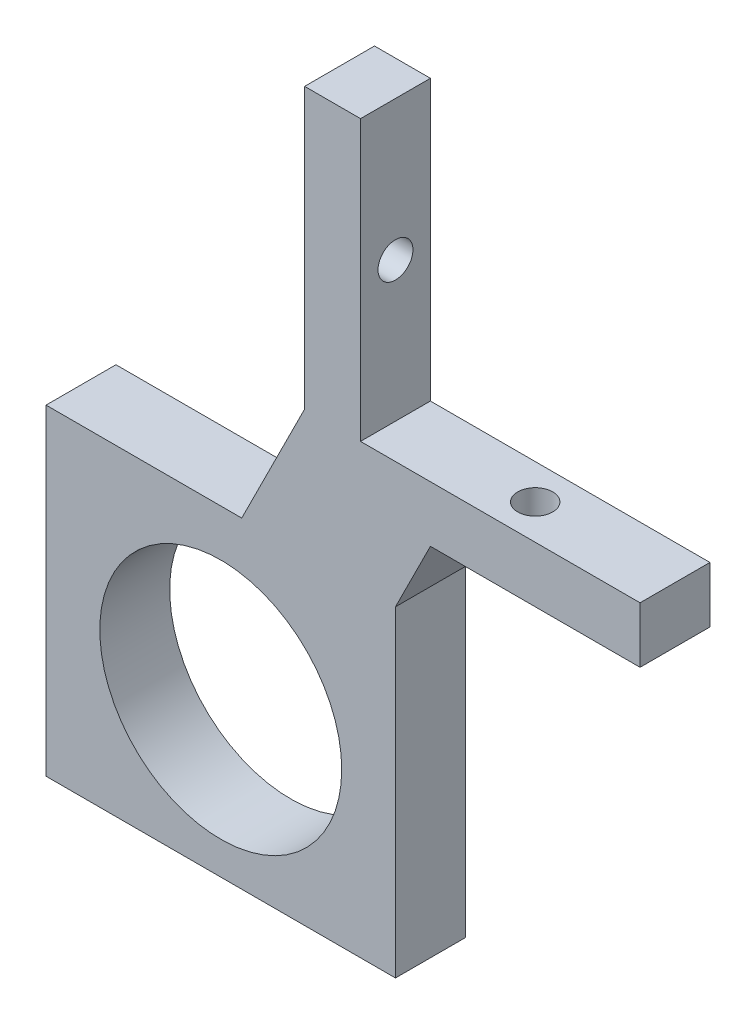
ISO-10303-21;
HEADER;
FILE_DESCRIPTION(('STEP AP214'),'2;1');
FILE_NAME('part.step','',(''),(''),'','','');
FILE_SCHEMA(('AUTOMOTIVE_DESIGN { 1 0 10303 214 1 1 1 1 }'));
ENDSEC;
DATA;
#1=APPLICATION_CONTEXT('core data for automotive mechanical design processes');
#2=APPLICATION_PROTOCOL_DEFINITION('international standard','automotive_design',2000,#1);
#3=PRODUCT_CONTEXT('',#1,'mechanical');
#4=PRODUCT('Part','Part','',(#3));
#5=PRODUCT_RELATED_PRODUCT_CATEGORY('part','',(#4));
#6=PRODUCT_DEFINITION_FORMATION('','',#4);
#7=PRODUCT_DEFINITION_CONTEXT('part definition',#1,'design');
#8=PRODUCT_DEFINITION('design','',#6,#7);
#9=PRODUCT_DEFINITION_SHAPE('','',#8);
#10=(LENGTH_UNIT() NAMED_UNIT(*) SI_UNIT(.MILLI.,.METRE.));
#11=(NAMED_UNIT(*) PLANE_ANGLE_UNIT() SI_UNIT($,.RADIAN.));
#12=(NAMED_UNIT(*) SI_UNIT($,.STERADIAN.) SOLID_ANGLE_UNIT());
#13=UNCERTAINTY_MEASURE_WITH_UNIT(LENGTH_MEASURE(1.E-05),#10,'distance_accuracy_value','');
#14=(GEOMETRIC_REPRESENTATION_CONTEXT(3) GLOBAL_UNCERTAINTY_ASSIGNED_CONTEXT((#13)) GLOBAL_UNIT_ASSIGNED_CONTEXT((#10,
#11,#12)) REPRESENTATION_CONTEXT('',''));
#15=CARTESIAN_POINT('',(0.,0.,0.));
#16=DIRECTION('',(0.,0.,1.));
#17=DIRECTION('',(1.,0.,0.));
#18=AXIS2_PLACEMENT_3D('',#15,#16,#17);
#19=CARTESIAN_POINT('',(2.54,0.,6.35));
#20=DIRECTION('',(1.,0.,0.));
#21=DIRECTION('',(0.,1.,0.));
#22=AXIS2_PLACEMENT_3D('',#19,#20,#21);
#23=PLANE('',#22);
#24=DIRECTION('',(0.,0.,1.));
#25=VECTOR('',#24,1.);
#26=CARTESIAN_POINT('',(2.54,7.62000000000001,6.35));
#27=LINE('',#26,#25);
#28=CARTESIAN_POINT('',(2.54,7.62000000000001,0.));
#29=VERTEX_POINT('',#28);
#30=CARTESIAN_POINT('',(2.54,7.62000000000001,6.35));
#31=VERTEX_POINT('',#30);
#32=EDGE_CURVE('E174',#29,#31,#27,.T.);
#33=ORIENTED_EDGE('',*,*,#32,.F.);
#34=DIRECTION('',(0.,-1.,0.));
#35=VECTOR('',#34,1.);
#36=CARTESIAN_POINT('',(2.54,0.,0.));
#37=LINE('',#36,#35);
#38=CARTESIAN_POINT('',(2.53999999999999,33.02,0.));
#39=VERTEX_POINT('',#38);
#40=EDGE_CURVE('E167',#39,#29,#37,.T.);
#41=ORIENTED_EDGE('',*,*,#40,.F.);
#42=DIRECTION('',(0.,0.,-1.));
#43=VECTOR('',#42,1.);
#44=CARTESIAN_POINT('',(2.53999999999999,33.02,6.35));
#45=LINE('',#44,#43);
#46=CARTESIAN_POINT('',(2.53999999999999,33.02,6.35));
#47=VERTEX_POINT('',#46);
#48=EDGE_CURVE('E11',#47,#39,#45,.T.);
#49=ORIENTED_EDGE('',*,*,#48,.F.);
#50=DIRECTION('',(0.,-1.,0.));
#51=VECTOR('',#50,1.);
#52=CARTESIAN_POINT('',(2.54,0.,6.35));
#53=LINE('',#52,#51);
#54=EDGE_CURVE('E151',#47,#31,#53,.T.);
#55=ORIENTED_EDGE('',*,*,#54,.T.);
#56=EDGE_LOOP('',(#33,#41,#49,#55));
#57=FACE_BOUND('',#56,.T.);
#58=CARTESIAN_POINT('',(2.54,20.32,3.175));
#59=DIRECTION('',(1.,0.,0.));
#60=DIRECTION('',(0.,1.,0.));
#61=AXIS2_PLACEMENT_3D('',#58,#59,#60);
#62=CIRCLE('',#61,1.5875);
#63=CARTESIAN_POINT('',(2.54,21.9075,3.175));
#64=VERTEX_POINT('',#63);
#65=EDGE_CURVE('E159',#64,#64,#62,.T.);
#66=ORIENTED_EDGE('',*,*,#65,.F.);
#67=EDGE_LOOP('',(#66));
#68=FACE_BOUND('',#67,.T.);
#69=ADVANCED_FACE('F35',(#57,#68),#23,.T.);
#70=CARTESIAN_POINT('',(0.,-33.02,6.35));
#71=DIRECTION('',(0.,-1.,0.));
#72=DIRECTION('',(0.,0.,-1.));
#73=AXIS2_PLACEMENT_3D('',#70,#71,#72);
#74=PLANE('',#73);
#75=DIRECTION('',(0.,0.,1.));
#76=VECTOR('',#75,1.);
#77=CARTESIAN_POINT('',(-26.035,-33.02,-28.2913701506307));
#78=LINE('',#77,#76);
#79=CARTESIAN_POINT('',(-26.035,-33.02,0.));
#80=VERTEX_POINT('',#79);
#81=CARTESIAN_POINT('',(-26.035,-33.02,6.35));
#82=VERTEX_POINT('',#81);
#83=EDGE_CURVE('E140',#80,#82,#78,.T.);
#84=ORIENTED_EDGE('',*,*,#83,.F.);
#85=DIRECTION('',(-1.,0.,0.));
#86=VECTOR('',#85,1.);
#87=CARTESIAN_POINT('',(0.,-33.02,0.));
#88=LINE('',#87,#86);
#89=CARTESIAN_POINT('',(5.71500000000001,-33.02,0.));
#90=VERTEX_POINT('',#89);
#91=EDGE_CURVE('E165',#90,#80,#88,.T.);
#92=ORIENTED_EDGE('',*,*,#91,.F.);
#93=DIRECTION('',(0.,0.,1.));
#94=VECTOR('',#93,1.);
#95=CARTESIAN_POINT('',(5.71500000000001,-33.02,-43.1426308887161));
#96=LINE('',#95,#94);
#97=CARTESIAN_POINT('',(5.71500000000001,-33.02,6.35));
#98=VERTEX_POINT('',#97);
#99=EDGE_CURVE('E149',#90,#98,#96,.T.);
#100=ORIENTED_EDGE('',*,*,#99,.T.);
#101=DIRECTION('',(-1.,0.,0.));
#102=VECTOR('',#101,1.);
#103=CARTESIAN_POINT('',(0.,-33.02,6.35));
#104=LINE('',#103,#102);
#105=EDGE_CURVE('E132',#98,#82,#104,.T.);
#106=ORIENTED_EDGE('',*,*,#105,.T.);
#107=EDGE_LOOP('',(#84,#92,#100,#106));
#108=FACE_BOUND('',#107,.T.);
#109=ADVANCED_FACE('F37',(#108),#74,.T.);
#110=CARTESIAN_POINT('',(0.,33.02,6.35));
#111=DIRECTION('',(0.,-1.,0.));
#112=DIRECTION('',(0.,0.,-1.));
#113=AXIS2_PLACEMENT_3D('',#110,#111,#112);
#114=PLANE('',#113);
#115=DIRECTION('',(-1.,0.,0.));
#116=VECTOR('',#115,1.);
#117=CARTESIAN_POINT('',(0.,33.02,0.));
#118=LINE('',#117,#116);
#119=CARTESIAN_POINT('',(-2.54000000000001,33.02,0.));
#120=VERTEX_POINT('',#119);
#121=EDGE_CURVE('E156',#39,#120,#118,.T.);
#122=ORIENTED_EDGE('',*,*,#121,.T.);
#123=DIRECTION('',(0.,0.,-1.));
#124=VECTOR('',#123,1.);
#125=CARTESIAN_POINT('',(-2.54000000000001,33.02,6.35));
#126=LINE('',#125,#124);
#127=CARTESIAN_POINT('',(-2.54000000000001,33.02,6.35));
#128=VERTEX_POINT('',#127);
#129=EDGE_CURVE('E44',#128,#120,#126,.T.);
#130=ORIENTED_EDGE('',*,*,#129,.F.);
#131=DIRECTION('',(-1.,0.,0.));
#132=VECTOR('',#131,1.);
#133=CARTESIAN_POINT('',(0.,33.02,6.35));
#134=LINE('',#133,#132);
#135=EDGE_CURVE('E154',#47,#128,#134,.T.);
#136=ORIENTED_EDGE('',*,*,#135,.F.);
#137=ORIENTED_EDGE('',*,*,#48,.T.);
#138=EDGE_LOOP('',(#122,#130,#136,#137));
#139=FACE_BOUND('',#138,.T.);
#140=ADVANCED_FACE('F224',(#139),#114,.F.);
#141=CARTESIAN_POINT('',(-2.54,0.,6.35));
#142=DIRECTION('',(1.,0.,0.));
#143=DIRECTION('',(0.,1.,0.));
#144=AXIS2_PLACEMENT_3D('',#141,#142,#143);
#145=PLANE('',#144);
#146=CARTESIAN_POINT('',(-2.54,20.32,3.175));
#147=DIRECTION('',(-1.,0.,0.));
#148=DIRECTION('',(0.,-1.,0.));
#149=AXIS2_PLACEMENT_3D('',#146,#147,#148);
#150=CIRCLE('',#149,1.5875);
#151=CARTESIAN_POINT('',(-2.54,18.7325,3.175));
#152=VERTEX_POINT('',#151);
#153=EDGE_CURVE('E209',#152,#152,#150,.T.);
#154=ORIENTED_EDGE('',*,*,#153,.F.);
#155=EDGE_LOOP('',(#154));
#156=FACE_BOUND('',#155,.T.);
#157=DIRECTION('',(0.,-1.,0.));
#158=VECTOR('',#157,1.);
#159=CARTESIAN_POINT('',(-2.54,0.,0.));
#160=LINE('',#159,#158);
#161=CARTESIAN_POINT('',(-2.54,7.62000000000002,0.));
#162=VERTEX_POINT('',#161);
#163=EDGE_CURVE('E152',#120,#162,#160,.T.);
#164=ORIENTED_EDGE('',*,*,#163,.T.);
#165=DIRECTION('',(0.,0.,1.));
#166=VECTOR('',#165,1.);
#167=CARTESIAN_POINT('',(-2.54000000000001,7.62000000000001,-14.1990316571237));
#168=LINE('',#167,#166);
#169=CARTESIAN_POINT('',(-2.54,7.62000000000002,6.35));
#170=VERTEX_POINT('',#169);
#171=EDGE_CURVE('E60',#162,#170,#168,.T.);
#172=ORIENTED_EDGE('',*,*,#171,.T.);
#173=DIRECTION('',(0.,-1.,0.));
#174=VECTOR('',#173,1.);
#175=CARTESIAN_POINT('',(-2.54,0.,6.35));
#176=LINE('',#175,#174);
#177=EDGE_CURVE('E163',#128,#170,#176,.T.);
#178=ORIENTED_EDGE('',*,*,#177,.F.);
#179=ORIENTED_EDGE('',*,*,#129,.T.);
#180=EDGE_LOOP('',(#164,#172,#178,#179));
#181=FACE_BOUND('',#180,.T.);
#182=ADVANCED_FACE('F227',(#156,#181),#145,.F.);
#183=CARTESIAN_POINT('',(0.,0.,6.35));
#184=DIRECTION('',(0.,0.,1.));
#185=DIRECTION('',(1.,0.,0.));
#186=AXIS2_PLACEMENT_3D('',#183,#184,#185);
#187=PLANE('',#186);
#188=DIRECTION('',(0.,-1.,0.));
#189=VECTOR('',#188,1.);
#190=CARTESIAN_POINT('',(-26.035,-3.80999999999998,6.35));
#191=LINE('',#190,#189);
#192=CARTESIAN_POINT('',(-26.035,-3.80999999999998,6.35));
#193=VERTEX_POINT('',#192);
#194=EDGE_CURVE('E126',#193,#82,#191,.T.);
#195=ORIENTED_EDGE('',*,*,#194,.T.);
#196=ORIENTED_EDGE('',*,*,#105,.F.);
#197=DIRECTION('',(0.,1.,0.));
#198=VECTOR('',#197,1.);
#199=CARTESIAN_POINT('',(5.715,-3.80999999999997,6.35));
#200=LINE('',#199,#198);
#201=CARTESIAN_POINT('',(5.715,-3.80999999999997,6.35));
#202=VERTEX_POINT('',#201);
#203=EDGE_CURVE('E139',#98,#202,#200,.T.);
#204=ORIENTED_EDGE('',*,*,#203,.T.);
#205=DIRECTION('',(0.447213595499958,0.894427190999916,0.));
#206=VECTOR('',#205,1.);
#207=CARTESIAN_POINT('',(2.54,-10.16,6.35));
#208=LINE('',#207,#206);
#209=CARTESIAN_POINT('',(8.89,2.54000000000001,6.35));
#210=VERTEX_POINT('',#209);
#211=EDGE_CURVE('E284',#202,#210,#208,.T.);
#212=ORIENTED_EDGE('',*,*,#211,.T.);
#213=DIRECTION('',(-1.,0.,0.));
#214=VECTOR('',#213,1.);
#215=CARTESIAN_POINT('',(27.94,2.54000000000001,6.35));
#216=LINE('',#215,#214);
#217=CARTESIAN_POINT('',(27.94,2.54000000000001,6.35));
#218=VERTEX_POINT('',#217);
#219=EDGE_CURVE('E207',#218,#210,#216,.T.);
#220=ORIENTED_EDGE('',*,*,#219,.F.);
#221=DIRECTION('',(0.,-1.,0.));
#222=VECTOR('',#221,1.);
#223=CARTESIAN_POINT('',(27.94,7.62000000000001,6.35));
#224=LINE('',#223,#222);
#225=CARTESIAN_POINT('',(27.94,7.62000000000001,6.35));
#226=VERTEX_POINT('',#225);
#227=EDGE_CURVE('E179',#226,#218,#224,.T.);
#228=ORIENTED_EDGE('',*,*,#227,.F.);
#229=DIRECTION('',(-1.,0.,0.));
#230=VECTOR('',#229,1.);
#231=CARTESIAN_POINT('',(27.94,7.62000000000001,6.35));
#232=LINE('',#231,#230);
#233=EDGE_CURVE('E197',#226,#31,#232,.T.);
#234=ORIENTED_EDGE('',*,*,#233,.T.);
#235=ORIENTED_EDGE('',*,*,#54,.F.);
#236=ORIENTED_EDGE('',*,*,#135,.T.);
#237=ORIENTED_EDGE('',*,*,#177,.T.);
#238=DIRECTION('',(-0.447213595499958,-0.894427190999916,0.));
#239=VECTOR('',#238,1.);
#240=CARTESIAN_POINT('',(-2.54000000000001,7.62000000000001,6.35));
#241=LINE('',#240,#239);
#242=CARTESIAN_POINT('',(-8.25499999999999,-3.80999999999997,6.35));
#243=VERTEX_POINT('',#242);
#244=EDGE_CURVE('E282',#170,#243,#241,.T.);
#245=ORIENTED_EDGE('',*,*,#244,.T.);
#246=DIRECTION('',(-1.,0.,0.));
#247=VECTOR('',#246,1.);
#248=CARTESIAN_POINT('',(-26.035,-3.80999999999998,6.35));
#249=LINE('',#248,#247);
#250=EDGE_CURVE('E135',#243,#193,#249,.T.);
#251=ORIENTED_EDGE('',*,*,#250,.T.);
#252=EDGE_LOOP('',(#195,#196,#204,#212,#220,#228,#234,#235,#236,#237,#245,#251));
#253=FACE_BOUND('',#252,.T.);
#254=CARTESIAN_POINT('',(-10.16,-19.05,6.35));
#255=DIRECTION('',(0.,0.,1.));
#256=DIRECTION('',(1.,0.,0.));
#257=AXIS2_PLACEMENT_3D('',#254,#255,#256);
#258=CIRCLE('',#257,10.99185);
#259=CARTESIAN_POINT('',(0.831850000000004,-19.05,6.35));
#260=VERTEX_POINT('',#259);
#261=EDGE_CURVE('E186',#260,#260,#258,.T.);
#262=ORIENTED_EDGE('',*,*,#261,.F.);
#263=EDGE_LOOP('',(#262));
#264=FACE_BOUND('',#263,.T.);
#265=ADVANCED_FACE('F128',(#253,#264),#187,.T.);
#266=CARTESIAN_POINT('',(0.,0.,0.));
#267=DIRECTION('',(0.,0.,1.));
#268=DIRECTION('',(1.,0.,0.));
#269=AXIS2_PLACEMENT_3D('',#266,#267,#268);
#270=PLANE('',#269);
#271=ORIENTED_EDGE('',*,*,#91,.T.);
#272=DIRECTION('',(0.,1.,0.));
#273=VECTOR('',#272,1.);
#274=CARTESIAN_POINT('',(-26.035,-3.80999999999998,0.));
#275=LINE('',#274,#273);
#276=CARTESIAN_POINT('',(-26.035,-3.80999999999998,0.));
#277=VERTEX_POINT('',#276);
#278=EDGE_CURVE('E144',#80,#277,#275,.T.);
#279=ORIENTED_EDGE('',*,*,#278,.T.);
#280=DIRECTION('',(1.,0.,0.));
#281=VECTOR('',#280,1.);
#282=CARTESIAN_POINT('',(-26.035,-3.80999999999998,0.));
#283=LINE('',#282,#281);
#284=CARTESIAN_POINT('',(-8.25499999999999,-3.80999999999997,0.));
#285=VERTEX_POINT('',#284);
#286=EDGE_CURVE('E52',#277,#285,#283,.T.);
#287=ORIENTED_EDGE('',*,*,#286,.T.);
#288=DIRECTION('',(0.447213595499958,0.894427190999916,0.));
#289=VECTOR('',#288,1.);
#290=CARTESIAN_POINT('',(-2.54000000000001,7.62000000000001,0.));
#291=LINE('',#290,#289);
#292=EDGE_CURVE('E283',#285,#162,#291,.T.);
#293=ORIENTED_EDGE('',*,*,#292,.T.);
#294=ORIENTED_EDGE('',*,*,#163,.F.);
#295=ORIENTED_EDGE('',*,*,#121,.F.);
#296=ORIENTED_EDGE('',*,*,#40,.T.);
#297=DIRECTION('',(-1.,0.,0.));
#298=VECTOR('',#297,1.);
#299=CARTESIAN_POINT('',(27.94,7.62000000000001,0.));
#300=LINE('',#299,#298);
#301=CARTESIAN_POINT('',(27.94,7.62000000000001,0.));
#302=VERTEX_POINT('',#301);
#303=EDGE_CURVE('E201',#302,#29,#300,.T.);
#304=ORIENTED_EDGE('',*,*,#303,.F.);
#305=DIRECTION('',(0.,1.,0.));
#306=VECTOR('',#305,1.);
#307=CARTESIAN_POINT('',(27.94,7.62000000000001,0.));
#308=LINE('',#307,#306);
#309=CARTESIAN_POINT('',(27.94,2.54000000000001,0.));
#310=VERTEX_POINT('',#309);
#311=EDGE_CURVE('E194',#310,#302,#308,.T.);
#312=ORIENTED_EDGE('',*,*,#311,.F.);
#313=DIRECTION('',(-1.,0.,0.));
#314=VECTOR('',#313,1.);
#315=CARTESIAN_POINT('',(27.94,2.54000000000001,0.));
#316=LINE('',#315,#314);
#317=CARTESIAN_POINT('',(8.89,2.54000000000001,0.));
#318=VERTEX_POINT('',#317);
#319=EDGE_CURVE('E204',#310,#318,#316,.T.);
#320=ORIENTED_EDGE('',*,*,#319,.T.);
#321=DIRECTION('',(-0.447213595499958,-0.894427190999916,0.));
#322=VECTOR('',#321,1.);
#323=CARTESIAN_POINT('',(2.54,-10.16,0.));
#324=LINE('',#323,#322);
#325=CARTESIAN_POINT('',(5.715,-3.80999999999997,0.));
#326=VERTEX_POINT('',#325);
#327=EDGE_CURVE('E286',#318,#326,#324,.T.);
#328=ORIENTED_EDGE('',*,*,#327,.T.);
#329=DIRECTION('',(0.,-1.,0.));
#330=VECTOR('',#329,1.);
#331=CARTESIAN_POINT('',(5.715,-3.80999999999997,0.));
#332=LINE('',#331,#330);
#333=EDGE_CURVE('E322',#326,#90,#332,.T.);
#334=ORIENTED_EDGE('',*,*,#333,.T.);
#335=EDGE_LOOP('',(#271,#279,#287,#293,#294,#295,#296,#304,#312,#320,#328,#334));
#336=FACE_BOUND('',#335,.T.);
#337=CARTESIAN_POINT('',(-10.16,-19.05,0.));
#338=DIRECTION('',(0.,0.,1.));
#339=DIRECTION('',(1.,0.,0.));
#340=AXIS2_PLACEMENT_3D('',#337,#338,#339);
#341=CIRCLE('',#340,10.99185);
#342=CARTESIAN_POINT('',(0.831850000000004,-19.05,0.));
#343=VERTEX_POINT('',#342);
#344=EDGE_CURVE('E39',#343,#343,#341,.T.);
#345=ORIENTED_EDGE('',*,*,#344,.T.);
#346=EDGE_LOOP('',(#345));
#347=FACE_BOUND('',#346,.T.);
#348=ADVANCED_FACE('F232',(#336,#347),#270,.F.);
#349=CARTESIAN_POINT('',(10.16,20.32,3.175));
#350=DIRECTION('',(-1.,0.,0.));
#351=DIRECTION('',(0.,-1.,0.));
#352=AXIS2_PLACEMENT_3D('',#349,#350,#351);
#353=CYLINDRICAL_SURFACE('',#352,1.5875);
#354=ORIENTED_EDGE('',*,*,#65,.T.);
#355=EDGE_LOOP('',(#354));
#356=FACE_BOUND('',#355,.T.);
#357=ORIENTED_EDGE('',*,*,#153,.T.);
#358=EDGE_LOOP('',(#357));
#359=FACE_BOUND('',#358,.T.);
#360=ADVANCED_FACE('F216',(#356,#359),#353,.F.);
#361=CARTESIAN_POINT('',(27.94,2.54000000000001,6.35));
#362=DIRECTION('',(0.,1.,0.));
#363=DIRECTION('',(0.,0.,1.));
#364=AXIS2_PLACEMENT_3D('',#361,#362,#363);
#365=PLANE('',#364);
#366=CARTESIAN_POINT('',(15.24,2.54000000000001,3.17499999999999));
#367=DIRECTION('',(0.,-1.,0.));
#368=DIRECTION('',(1.,0.,0.));
#369=AXIS2_PLACEMENT_3D('',#366,#367,#368);
#370=CIRCLE('',#369,1.5875);
#371=CARTESIAN_POINT('',(16.8275,2.54000000000001,3.17499999999999));
#372=VERTEX_POINT('',#371);
#373=EDGE_CURVE('E175',#372,#372,#370,.T.);
#374=ORIENTED_EDGE('',*,*,#373,.F.);
#375=EDGE_LOOP('',(#374));
#376=FACE_BOUND('',#375,.T.);
#377=ORIENTED_EDGE('',*,*,#219,.T.);
#378=DIRECTION('',(0.,0.,1.));
#379=VECTOR('',#378,1.);
#380=CARTESIAN_POINT('',(8.89,2.54000000000001,-14.1990316571237));
#381=LINE('',#380,#379);
#382=EDGE_CURVE('E290',#318,#210,#381,.T.);
#383=ORIENTED_EDGE('',*,*,#382,.F.);
#384=ORIENTED_EDGE('',*,*,#319,.F.);
#385=DIRECTION('',(0.,0.,-1.));
#386=VECTOR('',#385,1.);
#387=CARTESIAN_POINT('',(27.94,2.54000000000001,6.35));
#388=LINE('',#387,#386);
#389=EDGE_CURVE('E192',#218,#310,#388,.T.);
#390=ORIENTED_EDGE('',*,*,#389,.F.);
#391=EDGE_LOOP('',(#377,#383,#384,#390));
#392=FACE_BOUND('',#391,.T.);
#393=ADVANCED_FACE('F239',(#376,#392),#365,.F.);
#394=CARTESIAN_POINT('',(27.94,7.62000000000001,6.35));
#395=DIRECTION('',(0.,-1.,0.));
#396=DIRECTION('',(1.,0.,0.));
#397=AXIS2_PLACEMENT_3D('',#394,#395,#396);
#398=PLANE('',#397);
#399=CARTESIAN_POINT('',(15.24,7.62000000000001,3.17499999999999));
#400=DIRECTION('',(0.,-1.,0.));
#401=DIRECTION('',(1.,0.,0.));
#402=AXIS2_PLACEMENT_3D('',#399,#400,#401);
#403=CIRCLE('',#402,1.5875);
#404=CARTESIAN_POINT('',(16.8275,7.62000000000001,3.17499999999999));
#405=VERTEX_POINT('',#404);
#406=EDGE_CURVE('E172',#405,#405,#403,.T.);
#407=ORIENTED_EDGE('',*,*,#406,.T.);
#408=EDGE_LOOP('',(#407));
#409=FACE_BOUND('',#408,.T.);
#410=ORIENTED_EDGE('',*,*,#32,.T.);
#411=ORIENTED_EDGE('',*,*,#233,.F.);
#412=DIRECTION('',(0.,0.,1.));
#413=VECTOR('',#412,1.);
#414=CARTESIAN_POINT('',(27.94,7.62000000000001,6.35));
#415=LINE('',#414,#413);
#416=EDGE_CURVE('E196',#302,#226,#415,.T.);
#417=ORIENTED_EDGE('',*,*,#416,.F.);
#418=ORIENTED_EDGE('',*,*,#303,.T.);
#419=EDGE_LOOP('',(#410,#411,#417,#418));
#420=FACE_BOUND('',#419,.T.);
#421=ADVANCED_FACE('F242',(#409,#420),#398,.F.);
#422=CARTESIAN_POINT('',(27.94,0.,0.));
#423=DIRECTION('',(1.,0.,0.));
#424=DIRECTION('',(0.,1.,0.));
#425=AXIS2_PLACEMENT_3D('',#422,#423,#424);
#426=PLANE('',#425);
#427=ORIENTED_EDGE('',*,*,#227,.T.);
#428=ORIENTED_EDGE('',*,*,#389,.T.);
#429=ORIENTED_EDGE('',*,*,#311,.T.);
#430=ORIENTED_EDGE('',*,*,#416,.T.);
#431=EDGE_LOOP('',(#427,#428,#429,#430));
#432=FACE_BOUND('',#431,.T.);
#433=ADVANCED_FACE('F246',(#432),#426,.T.);
#434=CARTESIAN_POINT('',(15.24,27.94,3.17499999999999));
#435=DIRECTION('',(0.,-1.,0.));
#436=DIRECTION('',(1.,0.,0.));
#437=AXIS2_PLACEMENT_3D('',#434,#435,#436);
#438=CYLINDRICAL_SURFACE('',#437,1.5875);
#439=ORIENTED_EDGE('',*,*,#373,.T.);
#440=EDGE_LOOP('',(#439));
#441=FACE_BOUND('',#440,.T.);
#442=ORIENTED_EDGE('',*,*,#406,.F.);
#443=EDGE_LOOP('',(#442));
#444=FACE_BOUND('',#443,.T.);
#445=ADVANCED_FACE('F249',(#441,#444),#438,.F.);
#446=CARTESIAN_POINT('',(-10.16,-19.05,-19.05));
#447=DIRECTION('',(0.,0.,1.));
#448=DIRECTION('',(1.,0.,0.));
#449=AXIS2_PLACEMENT_3D('',#446,#447,#448);
#450=CYLINDRICAL_SURFACE('',#449,10.99185);
#451=ORIENTED_EDGE('',*,*,#261,.T.);
#452=EDGE_LOOP('',(#451));
#453=FACE_BOUND('',#452,.T.);
#454=ORIENTED_EDGE('',*,*,#344,.F.);
#455=EDGE_LOOP('',(#454));
#456=FACE_BOUND('',#455,.T.);
#457=ADVANCED_FACE('F253',(#453,#456),#450,.F.);
#458=CARTESIAN_POINT('',(-2.54000000000001,7.62000000000001,-14.1990316571237));
#459=DIRECTION('',(-0.894427190999916,0.447213595499958,0.));
#460=DIRECTION('',(-0.447213595499958,-0.894427190999916,0.));
#461=AXIS2_PLACEMENT_3D('',#458,#459,#460);
#462=PLANE('',#461);
#463=DIRECTION('',(0.,0.,-1.));
#464=VECTOR('',#463,1.);
#465=CARTESIAN_POINT('',(-8.25499999999999,-3.80999999999997,-14.1990316571237));
#466=LINE('',#465,#464);
#467=EDGE_CURVE('E277',#243,#285,#466,.T.);
#468=ORIENTED_EDGE('',*,*,#467,.F.);
#469=ORIENTED_EDGE('',*,*,#244,.F.);
#470=ORIENTED_EDGE('',*,*,#171,.F.);
#471=ORIENTED_EDGE('',*,*,#292,.F.);
#472=EDGE_LOOP('',(#468,#469,#470,#471));
#473=FACE_BOUND('',#472,.T.);
#474=ADVANCED_FACE('F256',(#473),#462,.T.);
#475=CARTESIAN_POINT('',(2.54,-10.16,-14.1990316571237));
#476=DIRECTION('',(0.894427190999916,-0.447213595499958,0.));
#477=DIRECTION('',(0.447213595499958,0.894427190999916,0.));
#478=AXIS2_PLACEMENT_3D('',#475,#476,#477);
#479=PLANE('',#478);
#480=DIRECTION('',(0.,0.,1.));
#481=VECTOR('',#480,1.);
#482=CARTESIAN_POINT('',(5.715,-3.80999999999997,-43.1426308887161));
#483=LINE('',#482,#481);
#484=EDGE_CURVE('E320',#326,#202,#483,.T.);
#485=ORIENTED_EDGE('',*,*,#484,.F.);
#486=ORIENTED_EDGE('',*,*,#327,.F.);
#487=ORIENTED_EDGE('',*,*,#382,.T.);
#488=ORIENTED_EDGE('',*,*,#211,.F.);
#489=EDGE_LOOP('',(#485,#486,#487,#488));
#490=FACE_BOUND('',#489,.T.);
#491=ADVANCED_FACE('F260',(#490),#479,.T.);
#492=CARTESIAN_POINT('',(5.715,-3.80999999999997,-43.1426308887161));
#493=DIRECTION('',(1.,0.,0.));
#494=DIRECTION('',(0.,1.,0.));
#495=AXIS2_PLACEMENT_3D('',#492,#493,#494);
#496=PLANE('',#495);
#497=ORIENTED_EDGE('',*,*,#333,.F.);
#498=ORIENTED_EDGE('',*,*,#484,.T.);
#499=ORIENTED_EDGE('',*,*,#203,.F.);
#500=ORIENTED_EDGE('',*,*,#99,.F.);
#501=EDGE_LOOP('',(#497,#498,#499,#500));
#502=FACE_BOUND('',#501,.T.);
#503=ADVANCED_FACE('F264',(#502),#496,.T.);
#504=CARTESIAN_POINT('',(-26.035,-3.80999999999998,-43.1426308887161));
#505=DIRECTION('',(-1.,0.,0.));
#506=DIRECTION('',(0.,-1.,0.));
#507=AXIS2_PLACEMENT_3D('',#504,#505,#506);
#508=PLANE('',#507);
#509=ORIENTED_EDGE('',*,*,#278,.F.);
#510=ORIENTED_EDGE('',*,*,#83,.T.);
#511=ORIENTED_EDGE('',*,*,#194,.F.);
#512=DIRECTION('',(0.,0.,1.));
#513=VECTOR('',#512,1.);
#514=CARTESIAN_POINT('',(-26.035,-3.80999999999998,-43.1426308887161));
#515=LINE('',#514,#513);
#516=EDGE_CURVE('E279',#277,#193,#515,.T.);
#517=ORIENTED_EDGE('',*,*,#516,.F.);
#518=EDGE_LOOP('',(#509,#510,#511,#517));
#519=FACE_BOUND('',#518,.T.);
#520=ADVANCED_FACE('F143',(#519),#508,.T.);
#521=CARTESIAN_POINT('',(-26.035,-3.80999999999998,-43.1426308887161));
#522=DIRECTION('',(0.,1.,0.));
#523=DIRECTION('',(-1.,0.,0.));
#524=AXIS2_PLACEMENT_3D('',#521,#522,#523);
#525=PLANE('',#524);
#526=ORIENTED_EDGE('',*,*,#250,.F.);
#527=ORIENTED_EDGE('',*,*,#467,.T.);
#528=ORIENTED_EDGE('',*,*,#286,.F.);
#529=ORIENTED_EDGE('',*,*,#516,.T.);
#530=EDGE_LOOP('',(#526,#527,#528,#529));
#531=FACE_BOUND('',#530,.T.);
#532=ADVANCED_FACE('F268',(#531),#525,.T.);
#533=CLOSED_SHELL('',(#69,#109,#140,#182,#265,#348,#360,#393,#421,#433,#445,#457,#474,#491,#503,
#520,#532));
#534=MANIFOLD_SOLID_BREP('B2',#533);
#535=ADVANCED_BREP_SHAPE_REPRESENTATION('',(#18,#534),#14);
#536=SHAPE_DEFINITION_REPRESENTATION(#9,#535);
ENDSEC;
END-ISO-10303-21;
